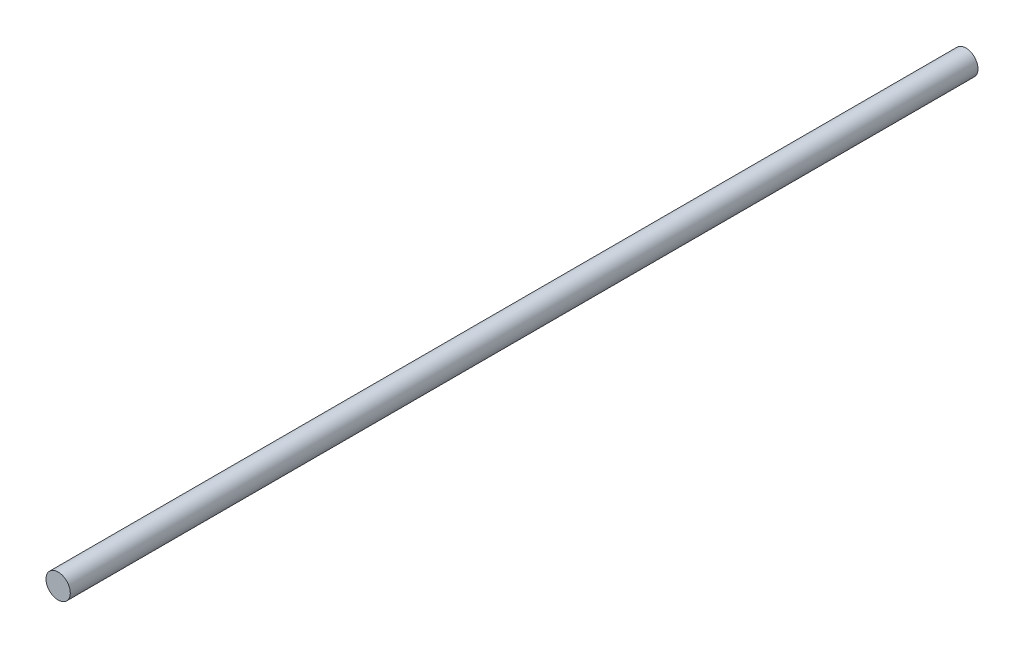
ISO-10303-21;
HEADER;
FILE_DESCRIPTION(('STEP AP214'),'2;1');
FILE_NAME('part.step','',(''),(''),'','','');
FILE_SCHEMA(('AUTOMOTIVE_DESIGN { 1 0 10303 214 1 1 1 1 }'));
ENDSEC;
DATA;
#1=APPLICATION_CONTEXT('core data for automotive mechanical design processes');
#2=APPLICATION_PROTOCOL_DEFINITION('international standard','automotive_design',2000,#1);
#3=PRODUCT_CONTEXT('',#1,'mechanical');
#4=PRODUCT('Part','Part','',(#3));
#5=PRODUCT_RELATED_PRODUCT_CATEGORY('part','',(#4));
#6=PRODUCT_DEFINITION_FORMATION('','',#4);
#7=PRODUCT_DEFINITION_CONTEXT('part definition',#1,'design');
#8=PRODUCT_DEFINITION('design','',#6,#7);
#9=PRODUCT_DEFINITION_SHAPE('','',#8);
#10=(LENGTH_UNIT() NAMED_UNIT(*) SI_UNIT(.MILLI.,.METRE.));
#11=(NAMED_UNIT(*) PLANE_ANGLE_UNIT() SI_UNIT($,.RADIAN.));
#12=(NAMED_UNIT(*) SI_UNIT($,.STERADIAN.) SOLID_ANGLE_UNIT());
#13=UNCERTAINTY_MEASURE_WITH_UNIT(LENGTH_MEASURE(1.E-05),#10,'distance_accuracy_value','');
#14=(GEOMETRIC_REPRESENTATION_CONTEXT(3) GLOBAL_UNCERTAINTY_ASSIGNED_CONTEXT((#13)) GLOBAL_UNIT_ASSIGNED_CONTEXT((#10,
#11,#12)) REPRESENTATION_CONTEXT('',''));
#15=CARTESIAN_POINT('',(0.,0.,0.));
#16=DIRECTION('',(0.,0.,1.));
#17=DIRECTION('',(1.,0.,0.));
#18=AXIS2_PLACEMENT_3D('',#15,#16,#17);
#19=CARTESIAN_POINT('',(0.,0.,177.8));
#20=DIRECTION('',(0.,0.,-1.));
#21=DIRECTION('',(-1.,0.,0.));
#22=AXIS2_PLACEMENT_3D('',#19,#20,#21);
#23=CYLINDRICAL_SURFACE('',#22,2.38125);
#24=CARTESIAN_POINT('',(0.,0.,177.8));
#25=DIRECTION('',(0.,0.,1.));
#26=DIRECTION('',(1.,0.,0.));
#27=AXIS2_PLACEMENT_3D('',#24,#25,#26);
#28=CIRCLE('',#27,2.38125);
#29=CARTESIAN_POINT('',(2.38125,0.,177.8));
#30=VERTEX_POINT('',#29);
#31=EDGE_CURVE('E10',#30,#30,#28,.T.);
#32=ORIENTED_EDGE('',*,*,#31,.F.);
#33=EDGE_LOOP('',(#32));
#34=FACE_BOUND('',#33,.T.);
#35=CARTESIAN_POINT('',(0.,0.,0.));
#36=DIRECTION('',(0.,0.,1.));
#37=DIRECTION('',(1.,0.,0.));
#38=AXIS2_PLACEMENT_3D('',#35,#36,#37);
#39=CIRCLE('',#38,2.38125);
#40=CARTESIAN_POINT('',(2.38125,0.,0.));
#41=VERTEX_POINT('',#40);
#42=EDGE_CURVE('E34',#41,#41,#39,.T.);
#43=ORIENTED_EDGE('',*,*,#42,.T.);
#44=EDGE_LOOP('',(#43));
#45=FACE_BOUND('',#44,.T.);
#46=ADVANCED_FACE('F31',(#34,#45),#23,.T.);
#47=CARTESIAN_POINT('',(0.,0.,177.8));
#48=DIRECTION('',(0.,0.,1.));
#49=DIRECTION('',(1.,0.,0.));
#50=AXIS2_PLACEMENT_3D('',#47,#48,#49);
#51=PLANE('',#50);
#52=ORIENTED_EDGE('',*,*,#31,.T.);
#53=EDGE_LOOP('',(#52));
#54=FACE_BOUND('',#53,.T.);
#55=ADVANCED_FACE('F46',(#54),#51,.T.);
#56=CARTESIAN_POINT('',(0.,0.,0.));
#57=DIRECTION('',(0.,0.,1.));
#58=DIRECTION('',(1.,0.,0.));
#59=AXIS2_PLACEMENT_3D('',#56,#57,#58);
#60=PLANE('',#59);
#61=ORIENTED_EDGE('',*,*,#42,.F.);
#62=EDGE_LOOP('',(#61));
#63=FACE_BOUND('',#62,.T.);
#64=ADVANCED_FACE('F44',(#63),#60,.F.);
#65=CLOSED_SHELL('',(#46,#55,#64));
#66=MANIFOLD_SOLID_BREP('B2',#65);
#67=ADVANCED_BREP_SHAPE_REPRESENTATION('',(#18,#66),#14);
#68=SHAPE_DEFINITION_REPRESENTATION(#9,#67);
ENDSEC;
END-ISO-10303-21;
